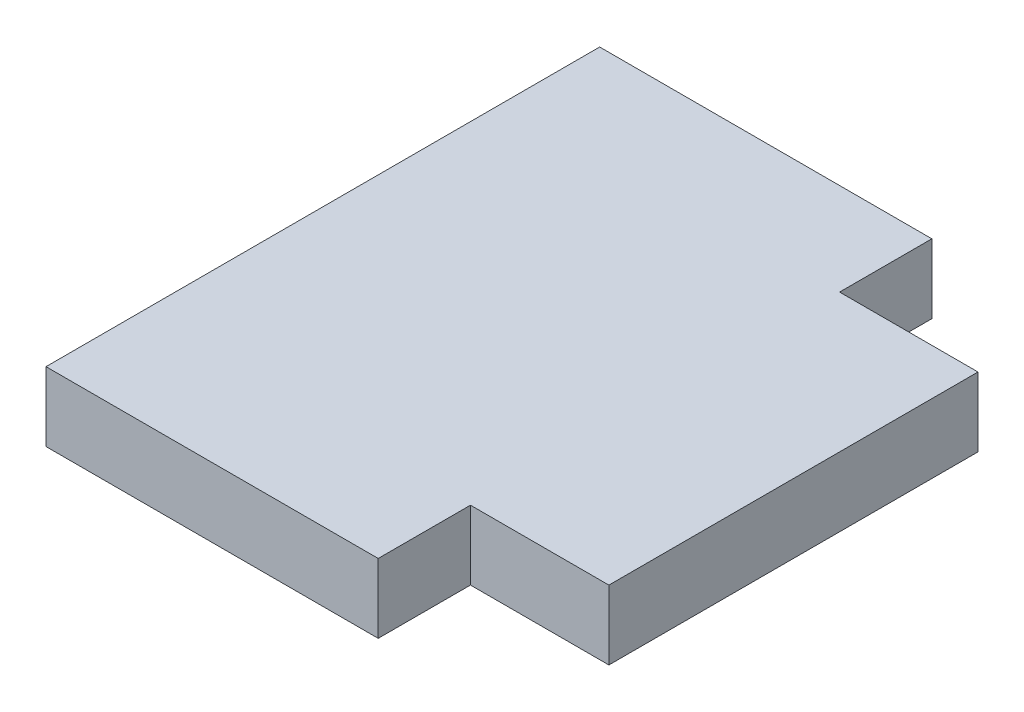
ISO-10303-21;
HEADER;
FILE_DESCRIPTION(('STEP AP214'),'2;1');
FILE_NAME('part.step','',(''),(''),'','','');
FILE_SCHEMA(('AUTOMOTIVE_DESIGN { 1 0 10303 214 1 1 1 1 }'));
ENDSEC;
DATA;
#1=APPLICATION_CONTEXT('core data for automotive mechanical design processes');
#2=APPLICATION_PROTOCOL_DEFINITION('international standard','automotive_design',2000,#1);
#3=PRODUCT_CONTEXT('',#1,'mechanical');
#4=PRODUCT('Part','Part','',(#3));
#5=PRODUCT_RELATED_PRODUCT_CATEGORY('part','',(#4));
#6=PRODUCT_DEFINITION_FORMATION('','',#4);
#7=PRODUCT_DEFINITION_CONTEXT('part definition',#1,'design');
#8=PRODUCT_DEFINITION('design','',#6,#7);
#9=PRODUCT_DEFINITION_SHAPE('','',#8);
#10=(LENGTH_UNIT() NAMED_UNIT(*) SI_UNIT(.MILLI.,.METRE.));
#11=(NAMED_UNIT(*) PLANE_ANGLE_UNIT() SI_UNIT($,.RADIAN.));
#12=(NAMED_UNIT(*) SI_UNIT($,.STERADIAN.) SOLID_ANGLE_UNIT());
#13=UNCERTAINTY_MEASURE_WITH_UNIT(LENGTH_MEASURE(1.E-05),#10,'distance_accuracy_value','');
#14=(GEOMETRIC_REPRESENTATION_CONTEXT(3) GLOBAL_UNCERTAINTY_ASSIGNED_CONTEXT((#13)) GLOBAL_UNIT_ASSIGNED_CONTEXT((#10,
#11,#12)) REPRESENTATION_CONTEXT('',''));
#15=CARTESIAN_POINT('',(0.,0.,0.));
#16=DIRECTION('',(0.,0.,1.));
#17=DIRECTION('',(1.,0.,0.));
#18=AXIS2_PLACEMENT_3D('',#15,#16,#17);
#19=CARTESIAN_POINT('',(0.,1.5,0.));
#20=DIRECTION('',(1.,0.,0.));
#21=DIRECTION('',(0.,0.,-1.));
#22=AXIS2_PLACEMENT_3D('',#19,#20,#21);
#23=PLANE('',#22);
#24=DIRECTION('',(0.,0.,1.));
#25=VECTOR('',#24,1.);
#26=CARTESIAN_POINT('',(0.,0.,0.));
#27=LINE('',#26,#25);
#28=CARTESIAN_POINT('',(0.,0.,-12.));
#29=VERTEX_POINT('',#28);
#30=CARTESIAN_POINT('',(0.,0.,0.));
#31=VERTEX_POINT('',#30);
#32=EDGE_CURVE('E118',#29,#31,#27,.T.);
#33=ORIENTED_EDGE('',*,*,#32,.T.);
#34=DIRECTION('',(0.,-1.,0.));
#35=VECTOR('',#34,1.);
#36=CARTESIAN_POINT('',(0.,1.5,0.));
#37=LINE('',#36,#35);
#38=CARTESIAN_POINT('',(0.,1.5,0.));
#39=VERTEX_POINT('',#38);
#40=EDGE_CURVE('E11',#39,#31,#37,.T.);
#41=ORIENTED_EDGE('',*,*,#40,.F.);
#42=DIRECTION('',(0.,0.,1.));
#43=VECTOR('',#42,1.);
#44=CARTESIAN_POINT('',(0.,1.5,0.));
#45=LINE('',#44,#43);
#46=CARTESIAN_POINT('',(0.,1.5,-12.));
#47=VERTEX_POINT('',#46);
#48=EDGE_CURVE('E126',#47,#39,#45,.T.);
#49=ORIENTED_EDGE('',*,*,#48,.F.);
#50=DIRECTION('',(0.,-1.,0.));
#51=VECTOR('',#50,1.);
#52=CARTESIAN_POINT('',(0.,1.5,-12.));
#53=LINE('',#52,#51);
#54=EDGE_CURVE('E41',#47,#29,#53,.T.);
#55=ORIENTED_EDGE('',*,*,#54,.T.);
#56=EDGE_LOOP('',(#33,#41,#49,#55));
#57=FACE_BOUND('',#56,.T.);
#58=ADVANCED_FACE('F34',(#57),#23,.F.);
#59=CARTESIAN_POINT('',(0.,1.5,0.));
#60=DIRECTION('',(0.,0.,-1.));
#61=DIRECTION('',(-1.,0.,0.));
#62=AXIS2_PLACEMENT_3D('',#59,#60,#61);
#63=PLANE('',#62);
#64=DIRECTION('',(1.,0.,0.));
#65=VECTOR('',#64,1.);
#66=CARTESIAN_POINT('',(0.,0.,0.));
#67=LINE('',#66,#65);
#68=CARTESIAN_POINT('',(7.2,0.,0.));
#69=VERTEX_POINT('',#68);
#70=EDGE_CURVE('E112',#31,#69,#67,.T.);
#71=ORIENTED_EDGE('',*,*,#70,.T.);
#72=DIRECTION('',(0.,1.,0.));
#73=VECTOR('',#72,1.);
#74=CARTESIAN_POINT('',(7.2,0.,0.));
#75=LINE('',#74,#73);
#76=CARTESIAN_POINT('',(7.2,1.5,0.));
#77=VERTEX_POINT('',#76);
#78=EDGE_CURVE('E98',#69,#77,#75,.T.);
#79=ORIENTED_EDGE('',*,*,#78,.T.);
#80=DIRECTION('',(1.,0.,0.));
#81=VECTOR('',#80,1.);
#82=CARTESIAN_POINT('',(0.,1.5,0.));
#83=LINE('',#82,#81);
#84=EDGE_CURVE('E137',#39,#77,#83,.T.);
#85=ORIENTED_EDGE('',*,*,#84,.F.);
#86=ORIENTED_EDGE('',*,*,#40,.T.);
#87=EDGE_LOOP('',(#71,#79,#85,#86));
#88=FACE_BOUND('',#87,.T.);
#89=ADVANCED_FACE('F115',(#88),#63,.F.);
#90=CARTESIAN_POINT('',(10.2,1.5,0.));
#91=DIRECTION('',(-1.,0.,0.));
#92=DIRECTION('',(0.,0.,1.));
#93=AXIS2_PLACEMENT_3D('',#90,#91,#92);
#94=PLANE('',#93);
#95=DIRECTION('',(0.,0.,-1.));
#96=VECTOR('',#95,1.);
#97=CARTESIAN_POINT('',(10.2,1.5,0.));
#98=LINE('',#97,#96);
#99=CARTESIAN_POINT('',(10.2,1.5,-2.));
#100=VERTEX_POINT('',#99);
#101=CARTESIAN_POINT('',(10.2,1.5,-10.));
#102=VERTEX_POINT('',#101);
#103=EDGE_CURVE('E132',#100,#102,#98,.T.);
#104=ORIENTED_EDGE('',*,*,#103,.F.);
#105=DIRECTION('',(0.,1.,0.));
#106=VECTOR('',#105,1.);
#107=CARTESIAN_POINT('',(10.2,0.,-2.));
#108=LINE('',#107,#106);
#109=CARTESIAN_POINT('',(10.2,0.,-2.));
#110=VERTEX_POINT('',#109);
#111=EDGE_CURVE('E105',#110,#100,#108,.T.);
#112=ORIENTED_EDGE('',*,*,#111,.F.);
#113=DIRECTION('',(0.,0.,-1.));
#114=VECTOR('',#113,1.);
#115=CARTESIAN_POINT('',(10.2,0.,0.));
#116=LINE('',#115,#114);
#117=CARTESIAN_POINT('',(10.2,0.,-10.));
#118=VERTEX_POINT('',#117);
#119=EDGE_CURVE('E56',#110,#118,#116,.T.);
#120=ORIENTED_EDGE('',*,*,#119,.T.);
#121=DIRECTION('',(0.,1.,0.));
#122=VECTOR('',#121,1.);
#123=CARTESIAN_POINT('',(10.2,0.,-10.));
#124=LINE('',#123,#122);
#125=EDGE_CURVE('E144',#118,#102,#124,.T.);
#126=ORIENTED_EDGE('',*,*,#125,.T.);
#127=EDGE_LOOP('',(#104,#112,#120,#126));
#128=FACE_BOUND('',#127,.T.);
#129=ADVANCED_FACE('F180',(#128),#94,.F.);
#130=CARTESIAN_POINT('',(0.,1.5,-12.));
#131=DIRECTION('',(0.,0.,1.));
#132=DIRECTION('',(1.,0.,0.));
#133=AXIS2_PLACEMENT_3D('',#130,#131,#132);
#134=PLANE('',#133);
#135=DIRECTION('',(-1.,0.,0.));
#136=VECTOR('',#135,1.);
#137=CARTESIAN_POINT('',(0.,1.5,-12.));
#138=LINE('',#137,#136);
#139=CARTESIAN_POINT('',(7.2,1.5,-12.));
#140=VERTEX_POINT('',#139);
#141=EDGE_CURVE('E128',#140,#47,#138,.T.);
#142=ORIENTED_EDGE('',*,*,#141,.F.);
#143=DIRECTION('',(0.,1.,0.));
#144=VECTOR('',#143,1.);
#145=CARTESIAN_POINT('',(7.2,0.,-12.));
#146=LINE('',#145,#144);
#147=CARTESIAN_POINT('',(7.2,0.,-12.));
#148=VERTEX_POINT('',#147);
#149=EDGE_CURVE('E122',#148,#140,#146,.T.);
#150=ORIENTED_EDGE('',*,*,#149,.F.);
#151=DIRECTION('',(-1.,0.,0.));
#152=VECTOR('',#151,1.);
#153=CARTESIAN_POINT('',(0.,0.,-12.));
#154=LINE('',#153,#152);
#155=EDGE_CURVE('E120',#148,#29,#154,.T.);
#156=ORIENTED_EDGE('',*,*,#155,.T.);
#157=ORIENTED_EDGE('',*,*,#54,.F.);
#158=EDGE_LOOP('',(#142,#150,#156,#157));
#159=FACE_BOUND('',#158,.T.);
#160=ADVANCED_FACE('F173',(#159),#134,.F.);
#161=CARTESIAN_POINT('',(0.,1.5,0.));
#162=DIRECTION('',(0.,-1.,0.));
#163=DIRECTION('',(0.,0.,-1.));
#164=AXIS2_PLACEMENT_3D('',#161,#162,#163);
#165=PLANE('',#164);
#166=ORIENTED_EDGE('',*,*,#84,.T.);
#167=DIRECTION('',(0.,0.,1.));
#168=VECTOR('',#167,1.);
#169=CARTESIAN_POINT('',(7.2,1.5,0.));
#170=LINE('',#169,#168);
#171=CARTESIAN_POINT('',(7.2,1.5,-2.));
#172=VERTEX_POINT('',#171);
#173=EDGE_CURVE('E101',#172,#77,#170,.T.);
#174=ORIENTED_EDGE('',*,*,#173,.F.);
#175=DIRECTION('',(-1.,0.,0.));
#176=VECTOR('',#175,1.);
#177=CARTESIAN_POINT('',(7.2,1.5,-2.));
#178=LINE('',#177,#176);
#179=EDGE_CURVE('E113',#100,#172,#178,.T.);
#180=ORIENTED_EDGE('',*,*,#179,.F.);
#181=ORIENTED_EDGE('',*,*,#103,.T.);
#182=DIRECTION('',(1.,0.,0.));
#183=VECTOR('',#182,1.);
#184=CARTESIAN_POINT('',(7.2,1.5,-10.));
#185=LINE('',#184,#183);
#186=CARTESIAN_POINT('',(7.2,1.5,-10.));
#187=VERTEX_POINT('',#186);
#188=EDGE_CURVE('E148',#187,#102,#185,.T.);
#189=ORIENTED_EDGE('',*,*,#188,.F.);
#190=DIRECTION('',(0.,0.,1.));
#191=VECTOR('',#190,1.);
#192=CARTESIAN_POINT('',(7.2,1.5,-12.));
#193=LINE('',#192,#191);
#194=EDGE_CURVE('E152',#140,#187,#193,.T.);
#195=ORIENTED_EDGE('',*,*,#194,.F.);
#196=ORIENTED_EDGE('',*,*,#141,.T.);
#197=ORIENTED_EDGE('',*,*,#48,.T.);
#198=EDGE_LOOP('',(#166,#174,#180,#181,#189,#195,#196,#197));
#199=FACE_BOUND('',#198,.T.);
#200=ADVANCED_FACE('F169',(#199),#165,.F.);
#201=CARTESIAN_POINT('',(0.,0.,0.));
#202=DIRECTION('',(0.,-1.,0.));
#203=DIRECTION('',(0.,0.,-1.));
#204=AXIS2_PLACEMENT_3D('',#201,#202,#203);
#205=PLANE('',#204);
#206=DIRECTION('',(0.,0.,1.));
#207=VECTOR('',#206,1.);
#208=CARTESIAN_POINT('',(7.2,0.,0.));
#209=LINE('',#208,#207);
#210=CARTESIAN_POINT('',(7.2,0.,-2.));
#211=VERTEX_POINT('',#210);
#212=EDGE_CURVE('E48',#211,#69,#209,.T.);
#213=ORIENTED_EDGE('',*,*,#212,.T.);
#214=ORIENTED_EDGE('',*,*,#70,.F.);
#215=ORIENTED_EDGE('',*,*,#32,.F.);
#216=ORIENTED_EDGE('',*,*,#155,.F.);
#217=DIRECTION('',(0.,0.,1.));
#218=VECTOR('',#217,1.);
#219=CARTESIAN_POINT('',(7.2,0.,-12.));
#220=LINE('',#219,#218);
#221=CARTESIAN_POINT('',(7.2,0.,-10.));
#222=VERTEX_POINT('',#221);
#223=EDGE_CURVE('E151',#148,#222,#220,.T.);
#224=ORIENTED_EDGE('',*,*,#223,.T.);
#225=DIRECTION('',(1.,0.,0.));
#226=VECTOR('',#225,1.);
#227=CARTESIAN_POINT('',(7.2,0.,-10.));
#228=LINE('',#227,#226);
#229=EDGE_CURVE('E145',#222,#118,#228,.T.);
#230=ORIENTED_EDGE('',*,*,#229,.T.);
#231=ORIENTED_EDGE('',*,*,#119,.F.);
#232=DIRECTION('',(-1.,0.,0.));
#233=VECTOR('',#232,1.);
#234=CARTESIAN_POINT('',(7.2,0.,-2.));
#235=LINE('',#234,#233);
#236=EDGE_CURVE('E106',#110,#211,#235,.T.);
#237=ORIENTED_EDGE('',*,*,#236,.T.);
#238=EDGE_LOOP('',(#213,#214,#215,#216,#224,#230,#231,#237));
#239=FACE_BOUND('',#238,.T.);
#240=ADVANCED_FACE('F110',(#239),#205,.T.);
#241=CARTESIAN_POINT('',(7.2,0.,-12.));
#242=DIRECTION('',(-1.,0.,0.));
#243=DIRECTION('',(0.,0.,1.));
#244=AXIS2_PLACEMENT_3D('',#241,#242,#243);
#245=PLANE('',#244);
#246=ORIENTED_EDGE('',*,*,#194,.T.);
#247=DIRECTION('',(0.,1.,0.));
#248=VECTOR('',#247,1.);
#249=CARTESIAN_POINT('',(7.2,0.,-10.));
#250=LINE('',#249,#248);
#251=EDGE_CURVE('E142',#222,#187,#250,.T.);
#252=ORIENTED_EDGE('',*,*,#251,.F.);
#253=ORIENTED_EDGE('',*,*,#223,.F.);
#254=ORIENTED_EDGE('',*,*,#149,.T.);
#255=EDGE_LOOP('',(#246,#252,#253,#254));
#256=FACE_BOUND('',#255,.T.);
#257=ADVANCED_FACE('F175',(#256),#245,.F.);
#258=CARTESIAN_POINT('',(7.2,0.,-10.));
#259=DIRECTION('',(0.,0.,1.));
#260=DIRECTION('',(1.,0.,0.));
#261=AXIS2_PLACEMENT_3D('',#258,#259,#260);
#262=PLANE('',#261);
#263=ORIENTED_EDGE('',*,*,#188,.T.);
#264=ORIENTED_EDGE('',*,*,#125,.F.);
#265=ORIENTED_EDGE('',*,*,#229,.F.);
#266=ORIENTED_EDGE('',*,*,#251,.T.);
#267=EDGE_LOOP('',(#263,#264,#265,#266));
#268=FACE_BOUND('',#267,.T.);
#269=ADVANCED_FACE('F178',(#268),#262,.F.);
#270=CARTESIAN_POINT('',(7.2,0.,0.));
#271=DIRECTION('',(-1.,0.,0.));
#272=DIRECTION('',(0.,0.,1.));
#273=AXIS2_PLACEMENT_3D('',#270,#271,#272);
#274=PLANE('',#273);
#275=ORIENTED_EDGE('',*,*,#173,.T.);
#276=ORIENTED_EDGE('',*,*,#78,.F.);
#277=ORIENTED_EDGE('',*,*,#212,.F.);
#278=DIRECTION('',(0.,1.,0.));
#279=VECTOR('',#278,1.);
#280=CARTESIAN_POINT('',(7.2,0.,-2.));
#281=LINE('',#280,#279);
#282=EDGE_CURVE('E155',#211,#172,#281,.T.);
#283=ORIENTED_EDGE('',*,*,#282,.T.);
#284=EDGE_LOOP('',(#275,#276,#277,#283));
#285=FACE_BOUND('',#284,.T.);
#286=ADVANCED_FACE('F99',(#285),#274,.F.);
#287=CARTESIAN_POINT('',(7.2,0.,-2.));
#288=DIRECTION('',(0.,0.,-1.));
#289=DIRECTION('',(-1.,0.,0.));
#290=AXIS2_PLACEMENT_3D('',#287,#288,#289);
#291=PLANE('',#290);
#292=ORIENTED_EDGE('',*,*,#179,.T.);
#293=ORIENTED_EDGE('',*,*,#282,.F.);
#294=ORIENTED_EDGE('',*,*,#236,.F.);
#295=ORIENTED_EDGE('',*,*,#111,.T.);
#296=EDGE_LOOP('',(#292,#293,#294,#295));
#297=FACE_BOUND('',#296,.T.);
#298=ADVANCED_FACE('F167',(#297),#291,.F.);
#299=CLOSED_SHELL('',(#58,#89,#129,#160,#200,#240,#257,#269,#286,#298));
#300=MANIFOLD_SOLID_BREP('B2',#299);
#301=ADVANCED_BREP_SHAPE_REPRESENTATION('',(#18,#300),#14);
#302=SHAPE_DEFINITION_REPRESENTATION(#9,#301);
ENDSEC;
END-ISO-10303-21;
